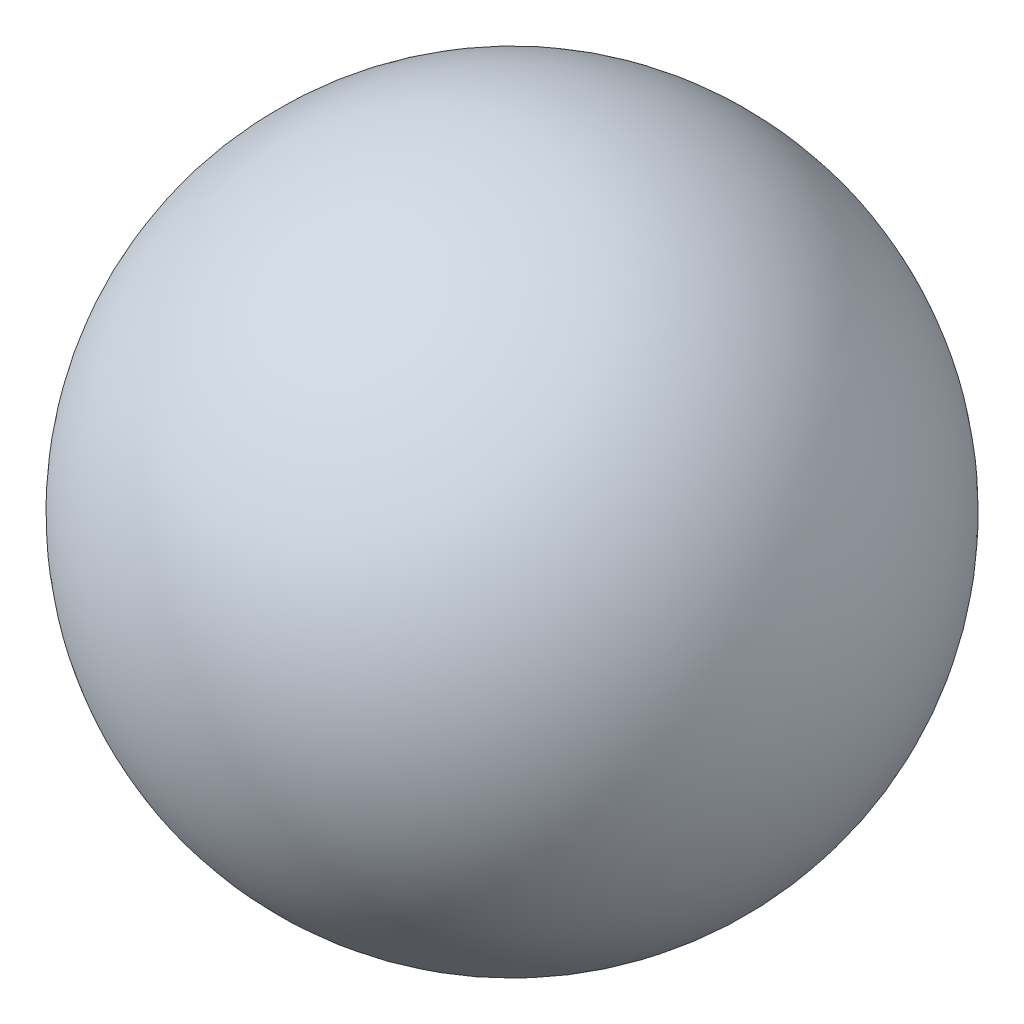
ISO-10303-21;
HEADER;
FILE_DESCRIPTION(('STEP AP214'),'2;1');
FILE_NAME('part.step','',(''),(''),'','','');
FILE_SCHEMA(('AUTOMOTIVE_DESIGN { 1 0 10303 214 1 1 1 1 }'));
ENDSEC;
DATA;
#1=APPLICATION_CONTEXT('core data for automotive mechanical design processes');
#2=APPLICATION_PROTOCOL_DEFINITION('international standard','automotive_design',2000,#1);
#3=PRODUCT_CONTEXT('',#1,'mechanical');
#4=PRODUCT('Part','Part','',(#3));
#5=PRODUCT_RELATED_PRODUCT_CATEGORY('part','',(#4));
#6=PRODUCT_DEFINITION_FORMATION('','',#4);
#7=PRODUCT_DEFINITION_CONTEXT('part definition',#1,'design');
#8=PRODUCT_DEFINITION('design','',#6,#7);
#9=PRODUCT_DEFINITION_SHAPE('','',#8);
#10=(LENGTH_UNIT() NAMED_UNIT(*) SI_UNIT(.MILLI.,.METRE.));
#11=(NAMED_UNIT(*) PLANE_ANGLE_UNIT() SI_UNIT($,.RADIAN.));
#12=(NAMED_UNIT(*) SI_UNIT($,.STERADIAN.) SOLID_ANGLE_UNIT());
#13=UNCERTAINTY_MEASURE_WITH_UNIT(LENGTH_MEASURE(1.E-05),#10,'distance_accuracy_value','');
#14=(GEOMETRIC_REPRESENTATION_CONTEXT(3) GLOBAL_UNCERTAINTY_ASSIGNED_CONTEXT((#13)) GLOBAL_UNIT_ASSIGNED_CONTEXT((#10,
#11,#12)) REPRESENTATION_CONTEXT('',''));
#15=CARTESIAN_POINT('',(0.,0.,0.));
#16=DIRECTION('',(0.,0.,1.));
#17=DIRECTION('',(1.,0.,0.));
#18=AXIS2_PLACEMENT_3D('',#15,#16,#17);
#19=CARTESIAN_POINT('',(0.,0.,0.));
#20=DIRECTION('',(0.,0.,1.));
#21=DIRECTION('',(-1.,0.,0.));
#22=AXIS2_PLACEMENT_3D('',#19,#20,#21);
#23=SPHERICAL_SURFACE('',#22,0.05);
#24=CARTESIAN_POINT('',(0.,0.,0.05));
#25=VERTEX_POINT('',#24);
#26=VERTEX_LOOP('',#25);
#27=FACE_BOUND('',#26,.T.);
#28=ADVANCED_FACE('F33',(#27),#23,.T.);
#29=CLOSED_SHELL('',(#28));
#30=MANIFOLD_SOLID_BREP('B2',#29);
#31=ADVANCED_BREP_SHAPE_REPRESENTATION('',(#18,#30),#14);
#32=SHAPE_DEFINITION_REPRESENTATION(#9,#31);
ENDSEC;
END-ISO-10303-21;
